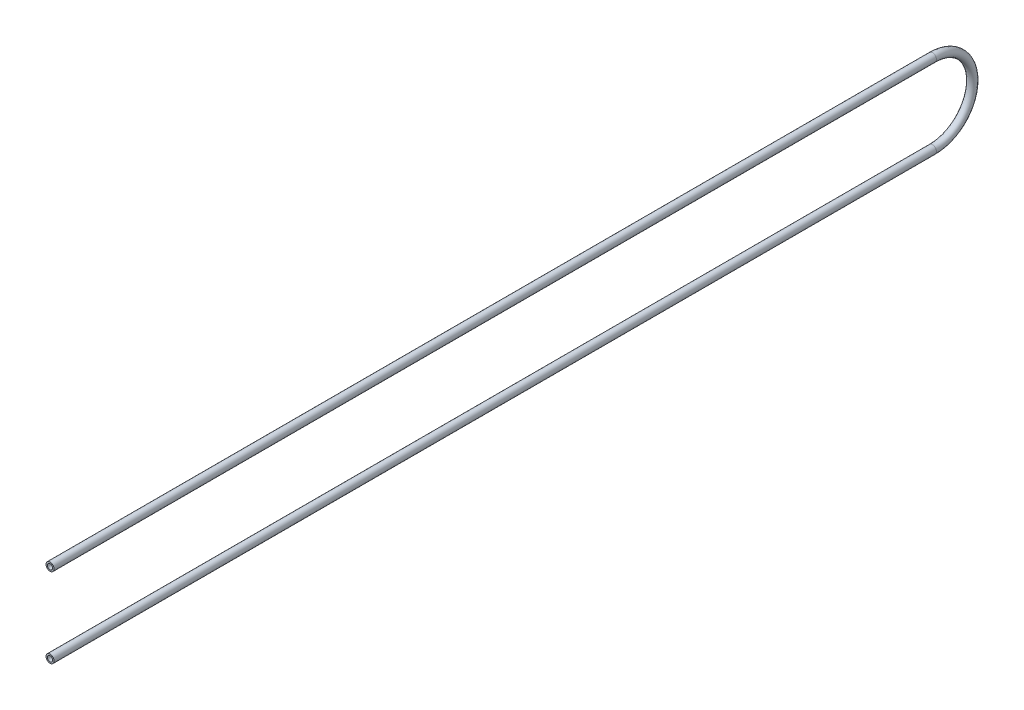
ISO-10303-21;
HEADER;
FILE_DESCRIPTION(('STEP AP214'),'2;1');
FILE_NAME('part.step','',(''),(''),'','','');
FILE_SCHEMA(('AUTOMOTIVE_DESIGN { 1 0 10303 214 1 1 1 1 }'));
ENDSEC;
DATA;
#1=APPLICATION_CONTEXT('core data for automotive mechanical design processes');
#2=APPLICATION_PROTOCOL_DEFINITION('international standard','automotive_design',2000,#1);
#3=PRODUCT_CONTEXT('',#1,'mechanical');
#4=PRODUCT('Part','Part','',(#3));
#5=PRODUCT_RELATED_PRODUCT_CATEGORY('part','',(#4));
#6=PRODUCT_DEFINITION_FORMATION('','',#4);
#7=PRODUCT_DEFINITION_CONTEXT('part definition',#1,'design');
#8=PRODUCT_DEFINITION('design','',#6,#7);
#9=PRODUCT_DEFINITION_SHAPE('','',#8);
#10=(LENGTH_UNIT() NAMED_UNIT(*) SI_UNIT(.MILLI.,.METRE.));
#11=(NAMED_UNIT(*) PLANE_ANGLE_UNIT() SI_UNIT($,.RADIAN.));
#12=(NAMED_UNIT(*) SI_UNIT($,.STERADIAN.) SOLID_ANGLE_UNIT());
#13=UNCERTAINTY_MEASURE_WITH_UNIT(LENGTH_MEASURE(1.E-05),#10,'distance_accuracy_value','');
#14=(GEOMETRIC_REPRESENTATION_CONTEXT(3) GLOBAL_UNCERTAINTY_ASSIGNED_CONTEXT((#13)) GLOBAL_UNIT_ASSIGNED_CONTEXT((#10,
#11,#12)) REPRESENTATION_CONTEXT('',''));
#15=CARTESIAN_POINT('',(0.,0.,0.));
#16=DIRECTION('',(0.,0.,1.));
#17=DIRECTION('',(1.,0.,0.));
#18=AXIS2_PLACEMENT_3D('',#15,#16,#17);
#19=CARTESIAN_POINT('',(0.,105.,0.));
#20=DIRECTION('',(0.,0.,-1.));
#21=DIRECTION('',(0.,1.,0.));
#22=AXIS2_PLACEMENT_3D('',#19,#20,#21);
#23=CYLINDRICAL_SURFACE('',#22,10.65);
#24=CARTESIAN_POINT('',(0.,105.,-2325.));
#25=DIRECTION('',(0.,0.,1.));
#26=DIRECTION('',(1.,0.,0.));
#27=AXIS2_PLACEMENT_3D('',#24,#25,#26);
#28=CIRCLE('',#27,10.65);
#29=CARTESIAN_POINT('',(0.,115.65,-2325.));
#30=VERTEX_POINT('',#29);
#31=EDGE_CURVE('E55',#30,#30,#28,.T.);
#32=ORIENTED_EDGE('',*,*,#31,.T.);
#33=EDGE_LOOP('',(#32));
#34=FACE_BOUND('',#33,.T.);
#35=CARTESIAN_POINT('',(0.,105.,0.));
#36=DIRECTION('',(0.,0.,1.));
#37=DIRECTION('',(1.,0.,0.));
#38=AXIS2_PLACEMENT_3D('',#35,#36,#37);
#39=CIRCLE('',#38,10.65);
#40=CARTESIAN_POINT('',(10.65,105.,0.));
#41=VERTEX_POINT('',#40);
#42=EDGE_CURVE('E53',#41,#41,#39,.T.);
#43=ORIENTED_EDGE('',*,*,#42,.F.);
#44=EDGE_LOOP('',(#43));
#45=FACE_BOUND('',#44,.T.);
#46=ADVANCED_FACE('F32',(#34,#45),#23,.T.);
#47=CARTESIAN_POINT('',(0.,0.,-2325.));
#48=DIRECTION('',(-1.,0.,0.));
#49=DIRECTION('',(0.,0.,1.));
#50=AXIS2_PLACEMENT_3D('',#47,#48,#49);
#51=TOROIDAL_SURFACE('',#50,105.,10.65);
#52=CARTESIAN_POINT('',(0.,-105.,-2325.));
#53=DIRECTION('',(0.,0.,-1.));
#54=DIRECTION('',(1.,0.,0.));
#55=AXIS2_PLACEMENT_3D('',#52,#53,#54);
#56=CIRCLE('',#55,10.65);
#57=CARTESIAN_POINT('',(0.,-115.65,-2325.));
#58=VERTEX_POINT('',#57);
#59=EDGE_CURVE('E36',#58,#58,#56,.T.);
#60=CARTESIAN_POINT('',(0.,0.,-2325.));
#61=DIRECTION('',(-1.,0.,0.));
#62=DIRECTION('',(0.,0.,1.));
#63=AXIS2_PLACEMENT_3D('',#60,#61,#62);
#64=CIRCLE('',#63,115.65);
#65=EDGE_CURVE('',#30,#58,#64,.T.);
#66=ORIENTED_EDGE('',*,*,#31,.F.);
#67=ORIENTED_EDGE('',*,*,#59,.T.);
#68=ORIENTED_EDGE('',*,*,#65,.T.);
#69=ORIENTED_EDGE('',*,*,#65,.F.);
#70=EDGE_LOOP('',(#66,#68,#67,#69));
#71=FACE_BOUND('',#70,.T.);
#72=ADVANCED_FACE('F62',(#71),#51,.T.);
#73=CARTESIAN_POINT('',(0.,-105.,-2325.));
#74=DIRECTION('',(0.,0.,1.));
#75=DIRECTION('',(0.,-1.,0.));
#76=AXIS2_PLACEMENT_3D('',#73,#74,#75);
#77=CYLINDRICAL_SURFACE('',#76,10.65);
#78=CARTESIAN_POINT('',(0.,-105.,0.));
#79=DIRECTION('',(0.,0.,-1.));
#80=DIRECTION('',(1.,0.,0.));
#81=AXIS2_PLACEMENT_3D('',#78,#79,#80);
#82=CIRCLE('',#81,10.65);
#83=CARTESIAN_POINT('',(10.65,-105.,0.));
#84=VERTEX_POINT('',#83);
#85=EDGE_CURVE('E49',#84,#84,#82,.T.);
#86=ORIENTED_EDGE('',*,*,#85,.T.);
#87=EDGE_LOOP('',(#86));
#88=FACE_BOUND('',#87,.T.);
#89=ORIENTED_EDGE('',*,*,#59,.F.);
#90=EDGE_LOOP('',(#89));
#91=FACE_BOUND('',#90,.T.);
#92=ADVANCED_FACE('F34',(#88,#91),#77,.T.);
#93=CARTESIAN_POINT('',(0.,105.,0.));
#94=DIRECTION('',(0.,0.,1.));
#95=DIRECTION('',(1.,0.,0.));
#96=AXIS2_PLACEMENT_3D('',#93,#94,#95);
#97=PLANE('',#96);
#98=CARTESIAN_POINT('',(0.,105.,0.));
#99=DIRECTION('',(0.,0.,1.));
#100=DIRECTION('',(1.,0.,0.));
#101=AXIS2_PLACEMENT_3D('',#98,#99,#100);
#102=CIRCLE('',#101,6.92);
#103=CARTESIAN_POINT('',(6.92,105.,0.));
#104=VERTEX_POINT('',#103);
#105=EDGE_CURVE('E52',#104,#104,#102,.F.);
#106=ORIENTED_EDGE('',*,*,#105,.T.);
#107=EDGE_LOOP('',(#106));
#108=FACE_BOUND('',#107,.T.);
#109=ORIENTED_EDGE('',*,*,#42,.T.);
#110=EDGE_LOOP('',(#109));
#111=FACE_BOUND('',#110,.T.);
#112=ADVANCED_FACE('F66',(#108,#111),#97,.T.);
#113=CARTESIAN_POINT('',(0.,-105.,0.));
#114=DIRECTION('',(0.,0.,-1.));
#115=DIRECTION('',(1.,0.,0.));
#116=AXIS2_PLACEMENT_3D('',#113,#114,#115);
#117=PLANE('',#116);
#118=CARTESIAN_POINT('',(0.,-105.,0.));
#119=DIRECTION('',(0.,0.,-1.));
#120=DIRECTION('',(1.,0.,0.));
#121=AXIS2_PLACEMENT_3D('',#118,#119,#120);
#122=CIRCLE('',#121,6.92);
#123=CARTESIAN_POINT('',(6.92,-105.,0.));
#124=VERTEX_POINT('',#123);
#125=EDGE_CURVE('E10',#124,#124,#122,.F.);
#126=ORIENTED_EDGE('',*,*,#125,.F.);
#127=EDGE_LOOP('',(#126));
#128=FACE_BOUND('',#127,.T.);
#129=ORIENTED_EDGE('',*,*,#85,.F.);
#130=EDGE_LOOP('',(#129));
#131=FACE_BOUND('',#130,.T.);
#132=ADVANCED_FACE('F72',(#128,#131),#117,.F.);
#133=CARTESIAN_POINT('',(0.,105.,0.));
#134=DIRECTION('',(0.,0.,-1.));
#135=DIRECTION('',(0.,1.,0.));
#136=AXIS2_PLACEMENT_3D('',#133,#134,#135);
#137=CYLINDRICAL_SURFACE('',#136,6.92);
#138=CARTESIAN_POINT('',(0.,105.,-2325.));
#139=DIRECTION('',(0.,0.,1.));
#140=DIRECTION('',(1.,0.,0.));
#141=AXIS2_PLACEMENT_3D('',#138,#139,#140);
#142=CIRCLE('',#141,6.92);
#143=CARTESIAN_POINT('',(0.,111.92,-2325.));
#144=VERTEX_POINT('',#143);
#145=EDGE_CURVE('E45',#144,#144,#142,.F.);
#146=ORIENTED_EDGE('',*,*,#145,.T.);
#147=EDGE_LOOP('',(#146));
#148=FACE_BOUND('',#147,.T.);
#149=ORIENTED_EDGE('',*,*,#105,.F.);
#150=EDGE_LOOP('',(#149));
#151=FACE_BOUND('',#150,.T.);
#152=ADVANCED_FACE('F82',(#148,#151),#137,.F.);
#153=CARTESIAN_POINT('',(0.,0.,-2325.));
#154=DIRECTION('',(-1.,0.,0.));
#155=DIRECTION('',(0.,0.,1.));
#156=AXIS2_PLACEMENT_3D('',#153,#154,#155);
#157=TOROIDAL_SURFACE('',#156,105.,6.92);
#158=CARTESIAN_POINT('',(0.,-105.,-2325.));
#159=DIRECTION('',(0.,0.,-1.));
#160=DIRECTION('',(1.,0.,0.));
#161=AXIS2_PLACEMENT_3D('',#158,#159,#160);
#162=CIRCLE('',#161,6.92);
#163=CARTESIAN_POINT('',(0.,-111.92,-2325.));
#164=VERTEX_POINT('',#163);
#165=EDGE_CURVE('E40',#164,#164,#162,.F.);
#166=CARTESIAN_POINT('',(0.,0.,-2325.));
#167=DIRECTION('',(-1.,0.,0.));
#168=DIRECTION('',(0.,0.,1.));
#169=AXIS2_PLACEMENT_3D('',#166,#167,#168);
#170=CIRCLE('',#169,111.92);
#171=EDGE_CURVE('',#144,#164,#170,.T.);
#172=ORIENTED_EDGE('',*,*,#145,.F.);
#173=ORIENTED_EDGE('',*,*,#165,.T.);
#174=ORIENTED_EDGE('',*,*,#171,.T.);
#175=ORIENTED_EDGE('',*,*,#171,.F.);
#176=EDGE_LOOP('',(#172,#174,#173,#175));
#177=FACE_BOUND('',#176,.T.);
#178=ADVANCED_FACE('F77',(#177),#157,.F.);
#179=CARTESIAN_POINT('',(0.,-105.,-2325.));
#180=DIRECTION('',(0.,0.,1.));
#181=DIRECTION('',(0.,-1.,0.));
#182=AXIS2_PLACEMENT_3D('',#179,#180,#181);
#183=CYLINDRICAL_SURFACE('',#182,6.92);
#184=ORIENTED_EDGE('',*,*,#125,.T.);
#185=EDGE_LOOP('',(#184));
#186=FACE_BOUND('',#185,.T.);
#187=ORIENTED_EDGE('',*,*,#165,.F.);
#188=EDGE_LOOP('',(#187));
#189=FACE_BOUND('',#188,.T.);
#190=ADVANCED_FACE('F75',(#186,#189),#183,.F.);
#191=CLOSED_SHELL('',(#46,#72,#92,#112,#132,#152,#178,#190));
#192=MANIFOLD_SOLID_BREP('B2',#191);
#193=ADVANCED_BREP_SHAPE_REPRESENTATION('',(#18,#192),#14);
#194=SHAPE_DEFINITION_REPRESENTATION(#9,#193);
ENDSEC;
END-ISO-10303-21;
